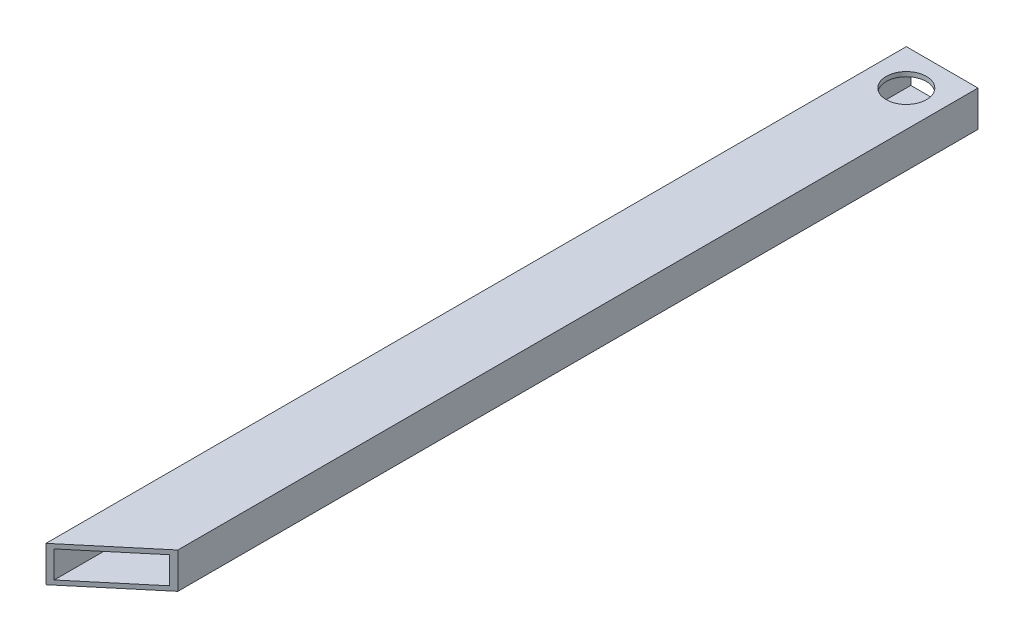
ISO-10303-21;
HEADER;
FILE_DESCRIPTION(('STEP AP214'),'2;1');
FILE_NAME('part.step','',(''),(''),'','','');
FILE_SCHEMA(('AUTOMOTIVE_DESIGN { 1 0 10303 214 1 1 1 1 }'));
ENDSEC;
DATA;
#1=APPLICATION_CONTEXT('core data for automotive mechanical design processes');
#2=APPLICATION_PROTOCOL_DEFINITION('international standard','automotive_design',2000,#1);
#3=PRODUCT_CONTEXT('',#1,'mechanical');
#4=PRODUCT('Part','Part','',(#3));
#5=PRODUCT_RELATED_PRODUCT_CATEGORY('part','',(#4));
#6=PRODUCT_DEFINITION_FORMATION('','',#4);
#7=PRODUCT_DEFINITION_CONTEXT('part definition',#1,'design');
#8=PRODUCT_DEFINITION('design','',#6,#7);
#9=PRODUCT_DEFINITION_SHAPE('','',#8);
#10=(LENGTH_UNIT() NAMED_UNIT(*) SI_UNIT(.MILLI.,.METRE.));
#11=(NAMED_UNIT(*) PLANE_ANGLE_UNIT() SI_UNIT($,.RADIAN.));
#12=(NAMED_UNIT(*) SI_UNIT($,.STERADIAN.) SOLID_ANGLE_UNIT());
#13=UNCERTAINTY_MEASURE_WITH_UNIT(LENGTH_MEASURE(1.E-05),#10,'distance_accuracy_value','');
#14=(GEOMETRIC_REPRESENTATION_CONTEXT(3) GLOBAL_UNCERTAINTY_ASSIGNED_CONTEXT((#13)) GLOBAL_UNIT_ASSIGNED_CONTEXT((#10,
#11,#12)) REPRESENTATION_CONTEXT('',''));
#15=CARTESIAN_POINT('',(0.,0.,0.));
#16=DIRECTION('',(0.,0.,1.));
#17=DIRECTION('',(1.,0.,0.));
#18=AXIS2_PLACEMENT_3D('',#15,#16,#17);
#19=CARTESIAN_POINT('',(0.,0.,609.6));
#20=DIRECTION('',(1.,0.,0.));
#21=DIRECTION('',(0.,0.,-1.));
#22=AXIS2_PLACEMENT_3D('',#19,#20,#21);
#23=PLANE('',#22);
#24=DIRECTION('',(0.,-1.,0.));
#25=VECTOR('',#24,1.);
#26=CARTESIAN_POINT('',(0.,0.,0.));
#27=LINE('',#26,#25);
#28=CARTESIAN_POINT('',(0.,25.4,0.));
#29=VERTEX_POINT('',#28);
#30=CARTESIAN_POINT('',(0.,0.,0.));
#31=VERTEX_POINT('',#30);
#32=EDGE_CURVE('E120',#29,#31,#27,.T.);
#33=ORIENTED_EDGE('',*,*,#32,.T.);
#34=DIRECTION('',(0.,0.,-1.));
#35=VECTOR('',#34,1.);
#36=CARTESIAN_POINT('',(0.,0.,609.6));
#37=LINE('',#36,#35);
#38=CARTESIAN_POINT('',(0.,0.,609.6));
#39=VERTEX_POINT('',#38);
#40=EDGE_CURVE('E40',#39,#31,#37,.T.);
#41=ORIENTED_EDGE('',*,*,#40,.F.);
#42=DIRECTION('',(0.,-1.,0.));
#43=VECTOR('',#42,1.);
#44=CARTESIAN_POINT('',(0.,0.,609.6));
#45=LINE('',#44,#43);
#46=CARTESIAN_POINT('',(0.,25.4,609.6));
#47=VERTEX_POINT('',#46);
#48=EDGE_CURVE('E96',#47,#39,#45,.T.);
#49=ORIENTED_EDGE('',*,*,#48,.F.);
#50=DIRECTION('',(0.,0.,-1.));
#51=VECTOR('',#50,1.);
#52=CARTESIAN_POINT('',(0.,25.4,609.6));
#53=LINE('',#52,#51);
#54=EDGE_CURVE('E107',#47,#29,#53,.T.);
#55=ORIENTED_EDGE('',*,*,#54,.T.);
#56=EDGE_LOOP('',(#33,#41,#49,#55));
#57=FACE_BOUND('',#56,.T.);
#58=ADVANCED_FACE('F33',(#57),#23,.F.);
#59=CARTESIAN_POINT('',(0.,0.,609.6));
#60=DIRECTION('',(0.,1.,0.));
#61=DIRECTION('',(0.,0.,1.));
#62=AXIS2_PLACEMENT_3D('',#59,#60,#61);
#63=PLANE('',#62);
#64=CARTESIAN_POINT('',(25.4,0.,522.7625812575));
#65=DIRECTION('',(0.,-1.,0.));
#66=DIRECTION('',(0.,0.,-1.));
#67=AXIS2_PLACEMENT_3D('',#64,#65,#66);
#68=CIRCLE('',#67,14.2875);
#69=CARTESIAN_POINT('',(25.4,0.,508.4750812575));
#70=VERTEX_POINT('',#69);
#71=EDGE_CURVE('E201',#70,#70,#68,.T.);
#72=ORIENTED_EDGE('',*,*,#71,.F.);
#73=EDGE_LOOP('',(#72));
#74=FACE_BOUND('',#73,.T.);
#75=CARTESIAN_POINT('',(25.4,0.,25.4));
#76=DIRECTION('',(0.,1.,0.));
#77=DIRECTION('',(0.,0.,1.));
#78=AXIS2_PLACEMENT_3D('',#75,#76,#77);
#79=CIRCLE('',#78,14.2875);
#80=CARTESIAN_POINT('',(25.4,0.,39.6875));
#81=VERTEX_POINT('',#80);
#82=EDGE_CURVE('E128',#81,#81,#79,.T.);
#83=ORIENTED_EDGE('',*,*,#82,.T.);
#84=EDGE_LOOP('',(#83));
#85=FACE_BOUND('',#84,.T.);
#86=DIRECTION('',(0.,0.,-1.));
#87=VECTOR('',#86,1.);
#88=CARTESIAN_POINT('',(50.8,0.,609.6));
#89=LINE('',#88,#87);
#90=CARTESIAN_POINT('',(50.8,0.,566.973738736194));
#91=VERTEX_POINT('',#90);
#92=CARTESIAN_POINT('',(50.8,0.,0.));
#93=VERTEX_POINT('',#92);
#94=EDGE_CURVE('E116',#91,#93,#89,.T.);
#95=ORIENTED_EDGE('',*,*,#94,.F.);
#96=DIRECTION('',(-0.766044443118978,0.,0.642787609686539));
#97=VECTOR('',#96,1.);
#98=CARTESIAN_POINT('',(50.8,0.,566.973738736194));
#99=LINE('',#98,#97);
#100=EDGE_CURVE('E99',#91,#39,#99,.T.);
#101=ORIENTED_EDGE('',*,*,#100,.T.);
#102=ORIENTED_EDGE('',*,*,#40,.T.);
#103=DIRECTION('',(1.,0.,0.));
#104=VECTOR('',#103,1.);
#105=CARTESIAN_POINT('',(0.,0.,0.));
#106=LINE('',#105,#104);
#107=EDGE_CURVE('E161',#31,#93,#106,.T.);
#108=ORIENTED_EDGE('',*,*,#107,.T.);
#109=EDGE_LOOP('',(#95,#101,#102,#108));
#110=FACE_BOUND('',#109,.T.);
#111=ADVANCED_FACE('F113',(#74,#85,#110),#63,.F.);
#112=CARTESIAN_POINT('',(50.8,0.,609.6));
#113=DIRECTION('',(-1.,0.,0.));
#114=DIRECTION('',(0.,0.,1.));
#115=AXIS2_PLACEMENT_3D('',#112,#113,#114);
#116=PLANE('',#115);
#117=DIRECTION('',(0.,0.,-1.));
#118=VECTOR('',#117,1.);
#119=CARTESIAN_POINT('',(50.8,25.4,609.6));
#120=LINE('',#119,#118);
#121=CARTESIAN_POINT('',(50.8,25.4,566.973738736194));
#122=VERTEX_POINT('',#121);
#123=CARTESIAN_POINT('',(50.8,25.4,0.));
#124=VERTEX_POINT('',#123);
#125=EDGE_CURVE('E122',#122,#124,#120,.T.);
#126=ORIENTED_EDGE('',*,*,#125,.F.);
#127=DIRECTION('',(0.,1.,0.));
#128=VECTOR('',#127,1.);
#129=CARTESIAN_POINT('',(50.8,0.,566.973738736194));
#130=LINE('',#129,#128);
#131=EDGE_CURVE('E117',#91,#122,#130,.T.);
#132=ORIENTED_EDGE('',*,*,#131,.F.);
#133=ORIENTED_EDGE('',*,*,#94,.T.);
#134=DIRECTION('',(0.,1.,0.));
#135=VECTOR('',#134,1.);
#136=CARTESIAN_POINT('',(50.8,0.,0.));
#137=LINE('',#136,#135);
#138=EDGE_CURVE('E163',#93,#124,#137,.T.);
#139=ORIENTED_EDGE('',*,*,#138,.T.);
#140=EDGE_LOOP('',(#126,#132,#133,#139));
#141=FACE_BOUND('',#140,.T.);
#142=ADVANCED_FACE('F173',(#141),#116,.F.);
#143=CARTESIAN_POINT('',(0.,25.4,609.6));
#144=DIRECTION('',(0.,-1.,0.));
#145=DIRECTION('',(0.,0.,-1.));
#146=AXIS2_PLACEMENT_3D('',#143,#144,#145);
#147=PLANE('',#146);
#148=CARTESIAN_POINT('',(25.4,25.4,25.4));
#149=DIRECTION('',(0.,1.,0.));
#150=DIRECTION('',(0.,0.,1.));
#151=AXIS2_PLACEMENT_3D('',#148,#149,#150);
#152=CIRCLE('',#151,14.2875);
#153=CARTESIAN_POINT('',(25.4,25.4,39.6875));
#154=VERTEX_POINT('',#153);
#155=EDGE_CURVE('E135',#154,#154,#152,.T.);
#156=ORIENTED_EDGE('',*,*,#155,.F.);
#157=EDGE_LOOP('',(#156));
#158=FACE_BOUND('',#157,.T.);
#159=ORIENTED_EDGE('',*,*,#54,.F.);
#160=DIRECTION('',(-0.766044443118978,0.,0.642787609686539));
#161=VECTOR('',#160,1.);
#162=CARTESIAN_POINT('',(50.8,25.4,566.973738736194));
#163=LINE('',#162,#161);
#164=EDGE_CURVE('E102',#122,#47,#163,.T.);
#165=ORIENTED_EDGE('',*,*,#164,.F.);
#166=ORIENTED_EDGE('',*,*,#125,.T.);
#167=DIRECTION('',(-1.,0.,0.));
#168=VECTOR('',#167,1.);
#169=CARTESIAN_POINT('',(0.,25.4,0.));
#170=LINE('',#169,#168);
#171=EDGE_CURVE('E108',#124,#29,#170,.T.);
#172=ORIENTED_EDGE('',*,*,#171,.T.);
#173=EDGE_LOOP('',(#159,#165,#166,#172));
#174=FACE_BOUND('',#173,.T.);
#175=ADVANCED_FACE('F169',(#158,#174),#147,.F.);
#176=CARTESIAN_POINT('',(0.,0.,0.));
#177=DIRECTION('',(0.,0.,-1.));
#178=DIRECTION('',(-1.,0.,0.));
#179=AXIS2_PLACEMENT_3D('',#176,#177,#178);
#180=PLANE('',#179);
#181=DIRECTION('',(0.,1.,0.));
#182=VECTOR('',#181,1.);
#183=CARTESIAN_POINT('',(3.175,3.175,0.));
#184=LINE('',#183,#182);
#185=CARTESIAN_POINT('',(3.175,3.175,0.));
#186=VERTEX_POINT('',#185);
#187=CARTESIAN_POINT('',(3.175,22.225,0.));
#188=VERTEX_POINT('',#187);
#189=EDGE_CURVE('E132',#186,#188,#184,.T.);
#190=ORIENTED_EDGE('',*,*,#189,.F.);
#191=DIRECTION('',(-1.,0.,0.));
#192=VECTOR('',#191,1.);
#193=CARTESIAN_POINT('',(3.175,3.175,0.));
#194=LINE('',#193,#192);
#195=CARTESIAN_POINT('',(47.625,3.175,0.));
#196=VERTEX_POINT('',#195);
#197=EDGE_CURVE('E150',#196,#186,#194,.T.);
#198=ORIENTED_EDGE('',*,*,#197,.F.);
#199=DIRECTION('',(0.,-1.,0.));
#200=VECTOR('',#199,1.);
#201=CARTESIAN_POINT('',(47.625,3.175,0.));
#202=LINE('',#201,#200);
#203=CARTESIAN_POINT('',(47.625,22.225,0.));
#204=VERTEX_POINT('',#203);
#205=EDGE_CURVE('E147',#204,#196,#202,.T.);
#206=ORIENTED_EDGE('',*,*,#205,.F.);
#207=DIRECTION('',(1.,0.,0.));
#208=VECTOR('',#207,1.);
#209=CARTESIAN_POINT('',(3.175,22.225,0.));
#210=LINE('',#209,#208);
#211=EDGE_CURVE('E145',#188,#204,#210,.T.);
#212=ORIENTED_EDGE('',*,*,#211,.F.);
#213=EDGE_LOOP('',(#190,#198,#206,#212));
#214=FACE_BOUND('',#213,.T.);
#215=ORIENTED_EDGE('',*,*,#32,.F.);
#216=ORIENTED_EDGE('',*,*,#171,.F.);
#217=ORIENTED_EDGE('',*,*,#138,.F.);
#218=ORIENTED_EDGE('',*,*,#107,.F.);
#219=EDGE_LOOP('',(#215,#216,#217,#218));
#220=FACE_BOUND('',#219,.T.);
#221=ADVANCED_FACE('F175',(#214,#220),#180,.T.);
#222=CARTESIAN_POINT('',(3.175,3.175,609.6));
#223=DIRECTION('',(-1.,0.,0.));
#224=DIRECTION('',(0.,0.,1.));
#225=AXIS2_PLACEMENT_3D('',#222,#223,#224);
#226=PLANE('',#225);
#227=DIRECTION('',(0.,0.,-1.));
#228=VECTOR('',#227,1.);
#229=CARTESIAN_POINT('',(3.175,22.225,609.6));
#230=LINE('',#229,#228);
#231=CARTESIAN_POINT('',(3.175,22.225,606.935858671012));
#232=VERTEX_POINT('',#231);
#233=EDGE_CURVE('E53',#232,#188,#230,.T.);
#234=ORIENTED_EDGE('',*,*,#233,.F.);
#235=DIRECTION('',(0.,-1.,0.));
#236=VECTOR('',#235,1.);
#237=CARTESIAN_POINT('',(3.175,3.175,606.935858671012));
#238=LINE('',#237,#236);
#239=CARTESIAN_POINT('',(3.175,3.175,606.935858671012));
#240=VERTEX_POINT('',#239);
#241=EDGE_CURVE('E47',#232,#240,#238,.T.);
#242=ORIENTED_EDGE('',*,*,#241,.T.);
#243=DIRECTION('',(0.,0.,-1.));
#244=VECTOR('',#243,1.);
#245=CARTESIAN_POINT('',(3.175,3.175,609.6));
#246=LINE('',#245,#244);
#247=EDGE_CURVE('E153',#240,#186,#246,.T.);
#248=ORIENTED_EDGE('',*,*,#247,.T.);
#249=ORIENTED_EDGE('',*,*,#189,.T.);
#250=EDGE_LOOP('',(#234,#242,#248,#249));
#251=FACE_BOUND('',#250,.T.);
#252=ADVANCED_FACE('F177',(#251),#226,.F.);
#253=CARTESIAN_POINT('',(3.175,3.175,609.6));
#254=DIRECTION('',(0.,-1.,0.));
#255=DIRECTION('',(0.,0.,-1.));
#256=AXIS2_PLACEMENT_3D('',#253,#254,#255);
#257=PLANE('',#256);
#258=CARTESIAN_POINT('',(25.4,3.175,522.7625812575));
#259=DIRECTION('',(0.,-1.,0.));
#260=DIRECTION('',(0.,0.,-1.));
#261=AXIS2_PLACEMENT_3D('',#258,#259,#260);
#262=CIRCLE('',#261,14.2875);
#263=CARTESIAN_POINT('',(25.4,3.175,508.4750812575));
#264=VERTEX_POINT('',#263);
#265=EDGE_CURVE('E203',#264,#264,#262,.T.);
#266=ORIENTED_EDGE('',*,*,#265,.T.);
#267=EDGE_LOOP('',(#266));
#268=FACE_BOUND('',#267,.T.);
#269=CARTESIAN_POINT('',(25.4,3.175,25.4));
#270=DIRECTION('',(0.,-1.,0.));
#271=DIRECTION('',(0.,0.,-1.));
#272=AXIS2_PLACEMENT_3D('',#269,#270,#271);
#273=CIRCLE('',#272,14.2875);
#274=CARTESIAN_POINT('',(25.4,3.175,11.1125));
#275=VERTEX_POINT('',#274);
#276=EDGE_CURVE('E127',#275,#275,#273,.T.);
#277=ORIENTED_EDGE('',*,*,#276,.T.);
#278=EDGE_LOOP('',(#277));
#279=FACE_BOUND('',#278,.T.);
#280=ORIENTED_EDGE('',*,*,#247,.F.);
#281=DIRECTION('',(0.766044443118979,0.,-0.642787609686539));
#282=VECTOR('',#281,1.);
#283=CARTESIAN_POINT('',(1.86316648204625,3.175,608.036617692093));
#284=LINE('',#283,#282);
#285=CARTESIAN_POINT('',(47.625,3.175,569.637880065182));
#286=VERTEX_POINT('',#285);
#287=EDGE_CURVE('E212',#240,#286,#284,.T.);
#288=ORIENTED_EDGE('',*,*,#287,.T.);
#289=DIRECTION('',(0.,0.,-1.));
#290=VECTOR('',#289,1.);
#291=CARTESIAN_POINT('',(47.625,3.175,609.6));
#292=LINE('',#291,#290);
#293=EDGE_CURVE('E155',#286,#196,#292,.T.);
#294=ORIENTED_EDGE('',*,*,#293,.T.);
#295=ORIENTED_EDGE('',*,*,#197,.T.);
#296=EDGE_LOOP('',(#280,#288,#294,#295));
#297=FACE_BOUND('',#296,.T.);
#298=ADVANCED_FACE('F184',(#268,#279,#297),#257,.F.);
#299=CARTESIAN_POINT('',(47.625,3.175,609.6));
#300=DIRECTION('',(1.,0.,0.));
#301=DIRECTION('',(0.,0.,-1.));
#302=AXIS2_PLACEMENT_3D('',#299,#300,#301);
#303=PLANE('',#302);
#304=ORIENTED_EDGE('',*,*,#293,.F.);
#305=DIRECTION('',(0.,1.,0.));
#306=VECTOR('',#305,1.);
#307=CARTESIAN_POINT('',(47.625,3.175,569.637880065182));
#308=LINE('',#307,#306);
#309=CARTESIAN_POINT('',(47.625,22.225,569.637880065182));
#310=VERTEX_POINT('',#309);
#311=EDGE_CURVE('E210',#286,#310,#308,.T.);
#312=ORIENTED_EDGE('',*,*,#311,.T.);
#313=DIRECTION('',(0.,0.,-1.));
#314=VECTOR('',#313,1.);
#315=CARTESIAN_POINT('',(47.625,22.225,609.6));
#316=LINE('',#315,#314);
#317=EDGE_CURVE('E157',#310,#204,#316,.T.);
#318=ORIENTED_EDGE('',*,*,#317,.T.);
#319=ORIENTED_EDGE('',*,*,#205,.T.);
#320=EDGE_LOOP('',(#304,#312,#318,#319));
#321=FACE_BOUND('',#320,.T.);
#322=ADVANCED_FACE('F223',(#321),#303,.F.);
#323=CARTESIAN_POINT('',(3.175,22.225,609.6));
#324=DIRECTION('',(0.,1.,0.));
#325=DIRECTION('',(0.,0.,1.));
#326=AXIS2_PLACEMENT_3D('',#323,#324,#325);
#327=PLANE('',#326);
#328=CARTESIAN_POINT('',(25.4,22.225,25.4));
#329=DIRECTION('',(0.,1.,0.));
#330=DIRECTION('',(0.,0.,1.));
#331=AXIS2_PLACEMENT_3D('',#328,#329,#330);
#332=CIRCLE('',#331,14.2875);
#333=CARTESIAN_POINT('',(25.4,22.225,39.6875));
#334=VERTEX_POINT('',#333);
#335=EDGE_CURVE('E125',#334,#334,#332,.T.);
#336=ORIENTED_EDGE('',*,*,#335,.T.);
#337=EDGE_LOOP('',(#336));
#338=FACE_BOUND('',#337,.T.);
#339=ORIENTED_EDGE('',*,*,#317,.F.);
#340=DIRECTION('',(-0.766044443118979,0.,0.642787609686539));
#341=VECTOR('',#340,1.);
#342=CARTESIAN_POINT('',(1.86316648204625,22.225,608.036617692093));
#343=LINE('',#342,#341);
#344=EDGE_CURVE('E11',#310,#232,#343,.T.);
#345=ORIENTED_EDGE('',*,*,#344,.T.);
#346=ORIENTED_EDGE('',*,*,#233,.T.);
#347=ORIENTED_EDGE('',*,*,#211,.T.);
#348=EDGE_LOOP('',(#339,#345,#346,#347));
#349=FACE_BOUND('',#348,.T.);
#350=ADVANCED_FACE('F221',(#338,#349),#327,.F.);
#351=CARTESIAN_POINT('',(25.4,0.,25.4));
#352=DIRECTION('',(0.,1.,0.));
#353=DIRECTION('',(0.,0.,1.));
#354=AXIS2_PLACEMENT_3D('',#351,#352,#353);
#355=CYLINDRICAL_SURFACE('',#354,14.2875);
#356=ORIENTED_EDGE('',*,*,#155,.T.);
#357=EDGE_LOOP('',(#356));
#358=FACE_BOUND('',#357,.T.);
#359=ORIENTED_EDGE('',*,*,#335,.F.);
#360=EDGE_LOOP('',(#359));
#361=FACE_BOUND('',#360,.T.);
#362=ADVANCED_FACE('F234',(#358,#361),#355,.F.);
#363=ORIENTED_EDGE('',*,*,#82,.F.);
#364=EDGE_LOOP('',(#363));
#365=FACE_BOUND('',#364,.T.);
#366=ORIENTED_EDGE('',*,*,#276,.F.);
#367=EDGE_LOOP('',(#366));
#368=FACE_BOUND('',#367,.T.);
#369=ADVANCED_FACE('F226',(#365,#368),#355,.F.);
#370=CARTESIAN_POINT('',(50.8,0.,566.973738736194));
#371=DIRECTION('',(-0.642787609686539,0.,-0.766044443118978));
#372=DIRECTION('',(-0.766044443118978,0.,0.642787609686539));
#373=AXIS2_PLACEMENT_3D('',#370,#371,#372);
#374=PLANE('',#373);
#375=ORIENTED_EDGE('',*,*,#164,.T.);
#376=ORIENTED_EDGE('',*,*,#48,.T.);
#377=ORIENTED_EDGE('',*,*,#100,.F.);
#378=ORIENTED_EDGE('',*,*,#131,.T.);
#379=EDGE_LOOP('',(#375,#376,#377,#378));
#380=FACE_BOUND('',#379,.T.);
#381=ORIENTED_EDGE('',*,*,#344,.F.);
#382=ORIENTED_EDGE('',*,*,#311,.F.);
#383=ORIENTED_EDGE('',*,*,#287,.F.);
#384=ORIENTED_EDGE('',*,*,#241,.F.);
#385=EDGE_LOOP('',(#381,#382,#383,#384));
#386=FACE_BOUND('',#385,.T.);
#387=ADVANCED_FACE('F98',(#380,#386),#374,.F.);
#388=CARTESIAN_POINT('',(25.4,3.175,522.7625812575));
#389=DIRECTION('',(0.,-1.,0.));
#390=DIRECTION('',(0.,0.,-1.));
#391=AXIS2_PLACEMENT_3D('',#388,#389,#390);
#392=CYLINDRICAL_SURFACE('',#391,14.2875);
#393=ORIENTED_EDGE('',*,*,#265,.F.);
#394=EDGE_LOOP('',(#393));
#395=FACE_BOUND('',#394,.T.);
#396=ORIENTED_EDGE('',*,*,#71,.T.);
#397=EDGE_LOOP('',(#396));
#398=FACE_BOUND('',#397,.T.);
#399=ADVANCED_FACE('F225',(#395,#398),#392,.F.);
#400=CLOSED_SHELL('',(#58,#111,#142,#175,#221,#252,#298,#322,#350,#362,#369,#387,#399));
#401=MANIFOLD_SOLID_BREP('B2',#400);
#402=ADVANCED_BREP_SHAPE_REPRESENTATION('',(#18,#401),#14);
#403=SHAPE_DEFINITION_REPRESENTATION(#9,#402);
ENDSEC;
END-ISO-10303-21;
